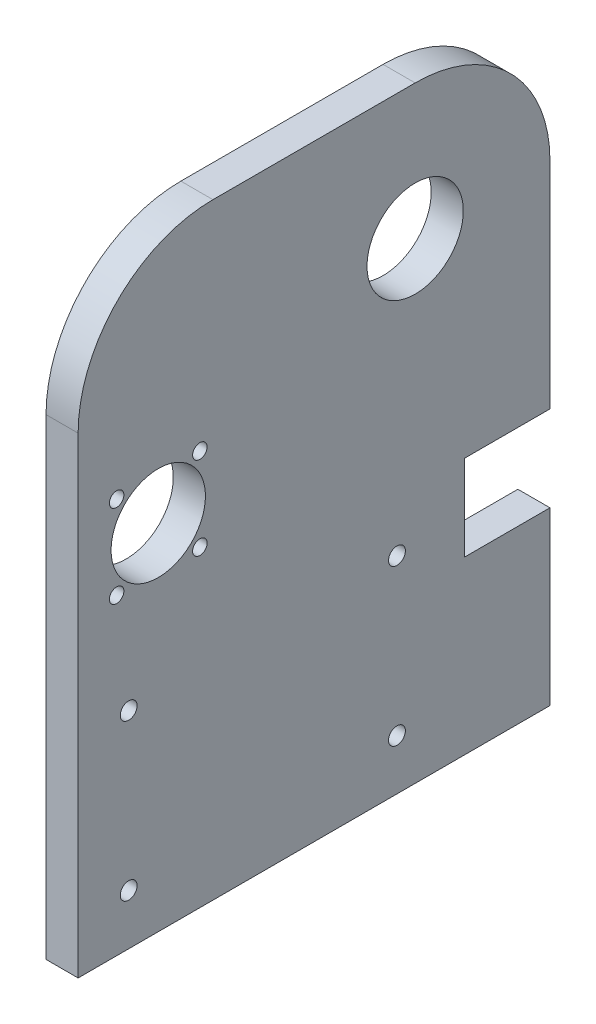
ISO-10303-21;
HEADER;
FILE_DESCRIPTION(('STEP AP214'),'2;1');
FILE_NAME('part.step','',(''),(''),'','','');
FILE_SCHEMA(('AUTOMOTIVE_DESIGN { 1 0 10303 214 1 1 1 1 }'));
ENDSEC;
DATA;
#1=APPLICATION_CONTEXT('core data for automotive mechanical design processes');
#2=APPLICATION_PROTOCOL_DEFINITION('international standard','automotive_design',2000,#1);
#3=PRODUCT_CONTEXT('',#1,'mechanical');
#4=PRODUCT('Part','Part','',(#3));
#5=PRODUCT_RELATED_PRODUCT_CATEGORY('part','',(#4));
#6=PRODUCT_DEFINITION_FORMATION('','',#4);
#7=PRODUCT_DEFINITION_CONTEXT('part definition',#1,'design');
#8=PRODUCT_DEFINITION('design','',#6,#7);
#9=PRODUCT_DEFINITION_SHAPE('','',#8);
#10=(LENGTH_UNIT() NAMED_UNIT(*) SI_UNIT(.MILLI.,.METRE.));
#11=(NAMED_UNIT(*) PLANE_ANGLE_UNIT() SI_UNIT($,.RADIAN.));
#12=(NAMED_UNIT(*) SI_UNIT($,.STERADIAN.) SOLID_ANGLE_UNIT());
#13=UNCERTAINTY_MEASURE_WITH_UNIT(LENGTH_MEASURE(1.E-05),#10,'distance_accuracy_value','');
#14=(GEOMETRIC_REPRESENTATION_CONTEXT(3) GLOBAL_UNCERTAINTY_ASSIGNED_CONTEXT((#13)) GLOBAL_UNIT_ASSIGNED_CONTEXT((#10,
#11,#12)) REPRESENTATION_CONTEXT('',''));
#15=CARTESIAN_POINT('',(0.,0.,0.));
#16=DIRECTION('',(0.,0.,1.));
#17=DIRECTION('',(1.,0.,0.));
#18=AXIS2_PLACEMENT_3D('',#15,#16,#17);
#19=CARTESIAN_POINT('',(-4.76250000000001,90.,-70.));
#20=DIRECTION('',(0.,0.,1.));
#21=DIRECTION('',(1.,0.,0.));
#22=AXIS2_PLACEMENT_3D('',#19,#20,#21);
#23=PLANE('',#22);
#24=DIRECTION('',(0.,-1.,0.));
#25=VECTOR('',#24,1.);
#26=CARTESIAN_POINT('',(-4.76250000000001,90.,-70.));
#27=LINE('',#26,#25);
#28=CARTESIAN_POINT('',(-4.76250000000001,50.,-70.));
#29=VERTEX_POINT('',#28);
#30=CARTESIAN_POINT('',(-4.76250000000001,-13.7746,-70.));
#31=VERTEX_POINT('',#30);
#32=EDGE_CURVE('E216',#29,#31,#27,.T.);
#33=ORIENTED_EDGE('',*,*,#32,.F.);
#34=DIRECTION('',(-1.,0.,0.));
#35=VECTOR('',#34,1.);
#36=CARTESIAN_POINT('',(4.76249999999999,50.,-70.));
#37=LINE('',#36,#35);
#38=CARTESIAN_POINT('',(4.76249999999999,50.,-70.));
#39=VERTEX_POINT('',#38);
#40=EDGE_CURVE('E11',#29,#39,#37,.F.);
#41=ORIENTED_EDGE('',*,*,#40,.T.);
#42=DIRECTION('',(0.,-1.,0.));
#43=VECTOR('',#42,1.);
#44=CARTESIAN_POINT('',(4.76249999999999,90.,-70.));
#45=LINE('',#44,#43);
#46=CARTESIAN_POINT('',(4.76250000000001,-13.7746,-70.));
#47=VERTEX_POINT('',#46);
#48=EDGE_CURVE('E219',#39,#47,#45,.T.);
#49=ORIENTED_EDGE('',*,*,#48,.T.);
#50=DIRECTION('',(-1.,0.,0.));
#51=VECTOR('',#50,1.);
#52=CARTESIAN_POINT('',(4.76250000000001,-13.7746,-70.));
#53=LINE('',#52,#51);
#54=EDGE_CURVE('E149',#47,#31,#53,.T.);
#55=ORIENTED_EDGE('',*,*,#54,.T.);
#56=EDGE_LOOP('',(#33,#41,#49,#55));
#57=FACE_BOUND('',#56,.T.);
#58=ADVANCED_FACE('F35',(#57),#23,.F.);
#59=CARTESIAN_POINT('',(4.76249999999999,90.,-70.));
#60=DIRECTION('',(-1.,0.,0.));
#61=DIRECTION('',(0.,0.,1.));
#62=AXIS2_PLACEMENT_3D('',#59,#60,#61);
#63=PLANE('',#62);
#64=CARTESIAN_POINT('',(4.76250000000002,-28.7746,-24.6));
#65=DIRECTION('',(-1.,0.,0.));
#66=DIRECTION('',(0.,0.,1.));
#67=AXIS2_PLACEMENT_3D('',#64,#65,#66);
#68=CIRCLE('',#67,2.5);
#69=CARTESIAN_POINT('',(4.76250000000002,-28.7746,-22.1));
#70=VERTEX_POINT('',#69);
#71=EDGE_CURVE('E352',#70,#70,#68,.T.);
#72=ORIENTED_EDGE('',*,*,#71,.T.);
#73=EDGE_LOOP('',(#72));
#74=FACE_BOUND('',#73,.T.);
#75=CARTESIAN_POINT('',(4.76250000000003,-28.7746,55.));
#76=DIRECTION('',(-1.,0.,0.));
#77=DIRECTION('',(0.,0.,1.));
#78=AXIS2_PLACEMENT_3D('',#75,#76,#77);
#79=CIRCLE('',#78,2.5);
#80=CARTESIAN_POINT('',(4.76250000000003,-28.7746,57.5));
#81=VERTEX_POINT('',#80);
#82=EDGE_CURVE('E361',#81,#81,#79,.T.);
#83=ORIENTED_EDGE('',*,*,#82,.T.);
#84=EDGE_LOOP('',(#83));
#85=FACE_BOUND('',#84,.T.);
#86=CARTESIAN_POINT('',(4.76250000000002,-75.,-24.6));
#87=DIRECTION('',(-1.,0.,0.));
#88=DIRECTION('',(0.,0.,1.));
#89=AXIS2_PLACEMENT_3D('',#86,#87,#88);
#90=CIRCLE('',#89,2.5);
#91=CARTESIAN_POINT('',(4.76250000000002,-75.,-22.1));
#92=VERTEX_POINT('',#91);
#93=EDGE_CURVE('E367',#92,#92,#90,.T.);
#94=ORIENTED_EDGE('',*,*,#93,.T.);
#95=EDGE_LOOP('',(#94));
#96=FACE_BOUND('',#95,.T.);
#97=CARTESIAN_POINT('',(4.76250000000003,-75.,55.));
#98=DIRECTION('',(-1.,0.,0.));
#99=DIRECTION('',(0.,0.,1.));
#100=AXIS2_PLACEMENT_3D('',#97,#98,#99);
#101=CIRCLE('',#100,2.5);
#102=CARTESIAN_POINT('',(4.76250000000003,-75.,57.5));
#103=VERTEX_POINT('',#102);
#104=EDGE_CURVE('E130',#103,#103,#101,.T.);
#105=ORIENTED_EDGE('',*,*,#104,.T.);
#106=EDGE_LOOP('',(#105));
#107=FACE_BOUND('',#106,.T.);
#108=CARTESIAN_POINT('',(4.76250000000001,15.,46.2289603759621));
#109=DIRECTION('',(-1.,0.,0.));
#110=DIRECTION('',(0.,0.,1.));
#111=AXIS2_PLACEMENT_3D('',#108,#109,#110);
#112=CIRCLE('',#111,14.);
#113=CARTESIAN_POINT('',(4.76250000000001,15.,60.2289603759621));
#114=VERTEX_POINT('',#113);
#115=EDGE_CURVE('E160',#114,#114,#112,.T.);
#116=ORIENTED_EDGE('',*,*,#115,.T.);
#117=EDGE_LOOP('',(#116));
#118=FACE_BOUND('',#117,.T.);
#119=CARTESIAN_POINT('',(4.76250000000001,2.65214783352988,58.5768125424322));
#120=DIRECTION('',(-1.,0.,0.));
#121=DIRECTION('',(0.,0.,1.));
#122=AXIS2_PLACEMENT_3D('',#119,#120,#121);
#123=CIRCLE('',#122,2.15);
#124=CARTESIAN_POINT('',(4.76250000000001,2.65214783352988,60.7268125424321));
#125=VERTEX_POINT('',#124);
#126=EDGE_CURVE('E166',#125,#125,#123,.T.);
#127=ORIENTED_EDGE('',*,*,#126,.T.);
#128=EDGE_LOOP('',(#127));
#129=FACE_BOUND('',#128,.T.);
#130=CARTESIAN_POINT('',(4.76250000000001,2.65214783352988,33.881108209492));
#131=DIRECTION('',(-1.,0.,0.));
#132=DIRECTION('',(0.,0.,1.));
#133=AXIS2_PLACEMENT_3D('',#130,#131,#132);
#134=CIRCLE('',#133,2.15);
#135=CARTESIAN_POINT('',(4.76250000000001,2.65214783352988,36.031108209492));
#136=VERTEX_POINT('',#135);
#137=EDGE_CURVE('E172',#136,#136,#134,.T.);
#138=ORIENTED_EDGE('',*,*,#137,.T.);
#139=EDGE_LOOP('',(#138));
#140=FACE_BOUND('',#139,.T.);
#141=CARTESIAN_POINT('',(4.76250000000001,27.3478521664701,58.5768125424321));
#142=DIRECTION('',(-1.,0.,0.));
#143=DIRECTION('',(0.,0.,1.));
#144=AXIS2_PLACEMENT_3D('',#141,#142,#143);
#145=CIRCLE('',#144,2.15);
#146=CARTESIAN_POINT('',(4.76250000000001,27.3478521664701,60.7268125424321));
#147=VERTEX_POINT('',#146);
#148=EDGE_CURVE('E178',#147,#147,#145,.T.);
#149=ORIENTED_EDGE('',*,*,#148,.T.);
#150=EDGE_LOOP('',(#149));
#151=FACE_BOUND('',#150,.T.);
#152=CARTESIAN_POINT('',(4.76250000000001,27.3478521664701,33.881108209492));
#153=DIRECTION('',(-1.,0.,0.));
#154=DIRECTION('',(0.,0.,1.));
#155=AXIS2_PLACEMENT_3D('',#152,#153,#154);
#156=CIRCLE('',#155,2.15);
#157=CARTESIAN_POINT('',(4.76250000000001,27.3478521664701,36.031108209492));
#158=VERTEX_POINT('',#157);
#159=EDGE_CURVE('E184',#158,#158,#156,.T.);
#160=ORIENTED_EDGE('',*,*,#159,.T.);
#161=EDGE_LOOP('',(#160));
#162=FACE_BOUND('',#161,.T.);
#163=CARTESIAN_POINT('',(4.7625,50.,-30.));
#164=DIRECTION('',(-1.,0.,0.));
#165=DIRECTION('',(0.,0.,1.));
#166=AXIS2_PLACEMENT_3D('',#163,#164,#165);
#167=CIRCLE('',#166,14.29);
#168=CARTESIAN_POINT('',(4.7625,50.,-15.71));
#169=VERTEX_POINT('',#168);
#170=EDGE_CURVE('E190',#169,#169,#167,.T.);
#171=ORIENTED_EDGE('',*,*,#170,.T.);
#172=EDGE_LOOP('',(#171));
#173=FACE_BOUND('',#172,.T.);
#174=DIRECTION('',(0.,0.,-1.));
#175=VECTOR('',#174,1.);
#176=CARTESIAN_POINT('',(4.76249999999999,90.,-70.));
#177=LINE('',#176,#175);
#178=CARTESIAN_POINT('',(4.7625,90.,30.));
#179=VERTEX_POINT('',#178);
#180=CARTESIAN_POINT('',(4.7625,90.,-30.));
#181=VERTEX_POINT('',#180);
#182=EDGE_CURVE('E194',#179,#181,#177,.T.);
#183=ORIENTED_EDGE('',*,*,#182,.F.);
#184=CARTESIAN_POINT('',(4.7625,50.,30.));
#185=DIRECTION('',(-1.,0.,0.));
#186=DIRECTION('',(0.,0.,1.));
#187=AXIS2_PLACEMENT_3D('',#184,#185,#186);
#188=CIRCLE('',#187,40.);
#189=CARTESIAN_POINT('',(4.76250000000001,50.,70.));
#190=VERTEX_POINT('',#189);
#191=EDGE_CURVE('E229',#179,#190,#188,.F.);
#192=ORIENTED_EDGE('',*,*,#191,.T.);
#193=DIRECTION('',(0.,-1.,0.));
#194=VECTOR('',#193,1.);
#195=CARTESIAN_POINT('',(4.76250000000001,90.,70.));
#196=LINE('',#195,#194);
#197=CARTESIAN_POINT('',(4.76250000000001,-90.,70.));
#198=VERTEX_POINT('',#197);
#199=EDGE_CURVE('E201',#190,#198,#196,.T.);
#200=ORIENTED_EDGE('',*,*,#199,.T.);
#201=DIRECTION('',(0.,0.,-1.));
#202=VECTOR('',#201,1.);
#203=CARTESIAN_POINT('',(4.76249999999999,-90.,-70.));
#204=LINE('',#203,#202);
#205=CARTESIAN_POINT('',(4.76249999999999,-90.,-70.));
#206=VERTEX_POINT('',#205);
#207=EDGE_CURVE('E193',#198,#206,#204,.T.);
#208=ORIENTED_EDGE('',*,*,#207,.T.);
#209=CARTESIAN_POINT('',(4.76250000000001,-39.1746,-70.));
#210=VERTEX_POINT('',#209);
#211=EDGE_CURVE('E218',#210,#206,#45,.T.);
#212=ORIENTED_EDGE('',*,*,#211,.F.);
#213=DIRECTION('',(0.,0.,1.));
#214=VECTOR('',#213,1.);
#215=CARTESIAN_POINT('',(4.76250000000001,-39.1746,-70.));
#216=LINE('',#215,#214);
#217=CARTESIAN_POINT('',(4.76250000000002,-39.1746,-44.6));
#218=VERTEX_POINT('',#217);
#219=EDGE_CURVE('E134',#210,#218,#216,.T.);
#220=ORIENTED_EDGE('',*,*,#219,.T.);
#221=DIRECTION('',(0.,1.,0.));
#222=VECTOR('',#221,1.);
#223=CARTESIAN_POINT('',(4.76250000000002,-13.7746,-44.6));
#224=LINE('',#223,#222);
#225=CARTESIAN_POINT('',(4.76250000000002,-13.7746,-44.6));
#226=VERTEX_POINT('',#225);
#227=EDGE_CURVE('E137',#218,#226,#224,.T.);
#228=ORIENTED_EDGE('',*,*,#227,.T.);
#229=DIRECTION('',(0.,0.,-1.));
#230=VECTOR('',#229,1.);
#231=CARTESIAN_POINT('',(4.76250000000001,-13.7746,-70.));
#232=LINE('',#231,#230);
#233=EDGE_CURVE('E141',#226,#47,#232,.T.);
#234=ORIENTED_EDGE('',*,*,#233,.T.);
#235=ORIENTED_EDGE('',*,*,#48,.F.);
#236=CARTESIAN_POINT('',(4.7625,50.,-30.));
#237=DIRECTION('',(-1.,0.,0.));
#238=DIRECTION('',(0.,0.,1.));
#239=AXIS2_PLACEMENT_3D('',#236,#237,#238);
#240=CIRCLE('',#239,40.);
#241=EDGE_CURVE('E227',#39,#181,#240,.F.);
#242=ORIENTED_EDGE('',*,*,#241,.T.);
#243=EDGE_LOOP('',(#183,#192,#200,#208,#212,#220,#228,#234,#235,#242));
#244=FACE_BOUND('',#243,.T.);
#245=ADVANCED_FACE('F242',(#74,#85,#96,#107,#118,#129,#140,#151,#162,#173,#244),#63,.F.);
#246=CARTESIAN_POINT('',(-4.76250000000001,-39.1745999999999,-70.));
#247=VERTEX_POINT('',#246);
#248=CARTESIAN_POINT('',(-4.76250000000001,-90.,-70.));
#249=VERTEX_POINT('',#248);
#250=EDGE_CURVE('E215',#247,#249,#27,.T.);
#251=ORIENTED_EDGE('',*,*,#250,.F.);
#252=DIRECTION('',(-1.,0.,0.));
#253=VECTOR('',#252,1.);
#254=CARTESIAN_POINT('',(4.76250000000001,-39.1746,-70.));
#255=LINE('',#254,#253);
#256=EDGE_CURVE('E143',#210,#247,#255,.T.);
#257=ORIENTED_EDGE('',*,*,#256,.F.);
#258=ORIENTED_EDGE('',*,*,#211,.T.);
#259=DIRECTION('',(-1.,0.,0.));
#260=VECTOR('',#259,1.);
#261=CARTESIAN_POINT('',(-4.76250000000001,-90.,-70.));
#262=LINE('',#261,#260);
#263=EDGE_CURVE('E204',#206,#249,#262,.T.);
#264=ORIENTED_EDGE('',*,*,#263,.T.);
#265=EDGE_LOOP('',(#251,#257,#258,#264));
#266=FACE_BOUND('',#265,.T.);
#267=ADVANCED_FACE('F254',(#266),#23,.F.);
#268=CARTESIAN_POINT('',(-4.76250000000001,90.,-70.));
#269=DIRECTION('',(1.,0.,0.));
#270=DIRECTION('',(0.,0.,-1.));
#271=AXIS2_PLACEMENT_3D('',#268,#269,#270);
#272=PLANE('',#271);
#273=CARTESIAN_POINT('',(-4.7625,-28.7746,-24.6));
#274=DIRECTION('',(-1.,0.,0.));
#275=DIRECTION('',(0.,0.,1.));
#276=AXIS2_PLACEMENT_3D('',#273,#274,#275);
#277=CIRCLE('',#276,2.49999999999999);
#278=CARTESIAN_POINT('',(-4.7625,-28.7746,-22.1));
#279=VERTEX_POINT('',#278);
#280=EDGE_CURVE('E354',#279,#279,#277,.T.);
#281=ORIENTED_EDGE('',*,*,#280,.F.);
#282=EDGE_LOOP('',(#281));
#283=FACE_BOUND('',#282,.T.);
#284=CARTESIAN_POINT('',(-4.76249999999999,-28.7746,55.));
#285=DIRECTION('',(-1.,0.,0.));
#286=DIRECTION('',(0.,0.,1.));
#287=AXIS2_PLACEMENT_3D('',#284,#285,#286);
#288=CIRCLE('',#287,2.49999999999999);
#289=CARTESIAN_POINT('',(-4.76249999999999,-28.7746,57.5));
#290=VERTEX_POINT('',#289);
#291=EDGE_CURVE('E356',#290,#290,#288,.T.);
#292=ORIENTED_EDGE('',*,*,#291,.F.);
#293=EDGE_LOOP('',(#292));
#294=FACE_BOUND('',#293,.T.);
#295=CARTESIAN_POINT('',(-4.7625,-75.,-24.6));
#296=DIRECTION('',(-1.,0.,0.));
#297=DIRECTION('',(0.,0.,1.));
#298=AXIS2_PLACEMENT_3D('',#295,#296,#297);
#299=CIRCLE('',#298,2.49999999999999);
#300=CARTESIAN_POINT('',(-4.7625,-75.,-22.1));
#301=VERTEX_POINT('',#300);
#302=EDGE_CURVE('E364',#301,#301,#299,.T.);
#303=ORIENTED_EDGE('',*,*,#302,.F.);
#304=EDGE_LOOP('',(#303));
#305=FACE_BOUND('',#304,.T.);
#306=CARTESIAN_POINT('',(-4.76249999999999,-75.,55.));
#307=DIRECTION('',(-1.,0.,0.));
#308=DIRECTION('',(0.,0.,1.));
#309=AXIS2_PLACEMENT_3D('',#306,#307,#308);
#310=CIRCLE('',#309,2.49999999999999);
#311=CARTESIAN_POINT('',(-4.76249999999999,-75.,57.5));
#312=VERTEX_POINT('',#311);
#313=EDGE_CURVE('E370',#312,#312,#310,.T.);
#314=ORIENTED_EDGE('',*,*,#313,.F.);
#315=EDGE_LOOP('',(#314));
#316=FACE_BOUND('',#315,.T.);
#317=CARTESIAN_POINT('',(-4.76249999999999,15.,46.2289603759621));
#318=DIRECTION('',(-1.,0.,0.));
#319=DIRECTION('',(0.,0.,1.));
#320=AXIS2_PLACEMENT_3D('',#317,#318,#319);
#321=CIRCLE('',#320,14.);
#322=CARTESIAN_POINT('',(-4.76249999999999,15.,60.2289603759621));
#323=VERTEX_POINT('',#322);
#324=EDGE_CURVE('E152',#323,#323,#321,.T.);
#325=ORIENTED_EDGE('',*,*,#324,.F.);
#326=EDGE_LOOP('',(#325));
#327=FACE_BOUND('',#326,.T.);
#328=CARTESIAN_POINT('',(-4.76249999999999,2.65214783352988,58.5768125424322));
#329=DIRECTION('',(-1.,0.,0.));
#330=DIRECTION('',(0.,0.,1.));
#331=AXIS2_PLACEMENT_3D('',#328,#329,#330);
#332=CIRCLE('',#331,2.15);
#333=CARTESIAN_POINT('',(-4.76249999999999,2.65214783352988,60.7268125424322));
#334=VERTEX_POINT('',#333);
#335=EDGE_CURVE('E163',#334,#334,#332,.T.);
#336=ORIENTED_EDGE('',*,*,#335,.F.);
#337=EDGE_LOOP('',(#336));
#338=FACE_BOUND('',#337,.T.);
#339=CARTESIAN_POINT('',(-4.76249999999999,2.65214783352988,33.881108209492));
#340=DIRECTION('',(-1.,0.,0.));
#341=DIRECTION('',(0.,0.,1.));
#342=AXIS2_PLACEMENT_3D('',#339,#340,#341);
#343=CIRCLE('',#342,2.15);
#344=CARTESIAN_POINT('',(-4.76249999999999,2.65214783352988,36.031108209492));
#345=VERTEX_POINT('',#344);
#346=EDGE_CURVE('E169',#345,#345,#343,.T.);
#347=ORIENTED_EDGE('',*,*,#346,.F.);
#348=EDGE_LOOP('',(#347));
#349=FACE_BOUND('',#348,.T.);
#350=CARTESIAN_POINT('',(-4.76249999999999,27.3478521664701,58.5768125424322));
#351=DIRECTION('',(-1.,0.,0.));
#352=DIRECTION('',(0.,0.,1.));
#353=AXIS2_PLACEMENT_3D('',#350,#351,#352);
#354=CIRCLE('',#353,2.15);
#355=CARTESIAN_POINT('',(-4.76249999999999,27.3478521664701,60.7268125424321));
#356=VERTEX_POINT('',#355);
#357=EDGE_CURVE('E175',#356,#356,#354,.T.);
#358=ORIENTED_EDGE('',*,*,#357,.F.);
#359=EDGE_LOOP('',(#358));
#360=FACE_BOUND('',#359,.T.);
#361=CARTESIAN_POINT('',(-4.76249999999999,27.3478521664701,33.881108209492));
#362=DIRECTION('',(-1.,0.,0.));
#363=DIRECTION('',(0.,0.,1.));
#364=AXIS2_PLACEMENT_3D('',#361,#362,#363);
#365=CIRCLE('',#364,2.15);
#366=CARTESIAN_POINT('',(-4.76249999999999,27.3478521664701,36.031108209492));
#367=VERTEX_POINT('',#366);
#368=EDGE_CURVE('E181',#367,#367,#365,.T.);
#369=ORIENTED_EDGE('',*,*,#368,.F.);
#370=EDGE_LOOP('',(#369));
#371=FACE_BOUND('',#370,.T.);
#372=CARTESIAN_POINT('',(-4.7625,50.,-30.));
#373=DIRECTION('',(-1.,0.,0.));
#374=DIRECTION('',(0.,0.,1.));
#375=AXIS2_PLACEMENT_3D('',#372,#373,#374);
#376=CIRCLE('',#375,14.29);
#377=CARTESIAN_POINT('',(-4.7625,50.,-15.71));
#378=VERTEX_POINT('',#377);
#379=EDGE_CURVE('E187',#378,#378,#376,.T.);
#380=ORIENTED_EDGE('',*,*,#379,.F.);
#381=EDGE_LOOP('',(#380));
#382=FACE_BOUND('',#381,.T.);
#383=DIRECTION('',(0.,-1.,0.));
#384=VECTOR('',#383,1.);
#385=CARTESIAN_POINT('',(-4.76249999999999,90.,70.));
#386=LINE('',#385,#384);
#387=CARTESIAN_POINT('',(-4.76249999999999,50.,70.));
#388=VERTEX_POINT('',#387);
#389=CARTESIAN_POINT('',(-4.76249999999999,-90.,70.));
#390=VERTEX_POINT('',#389);
#391=EDGE_CURVE('E213',#388,#390,#386,.T.);
#392=ORIENTED_EDGE('',*,*,#391,.F.);
#393=CARTESIAN_POINT('',(-4.7625,50.,30.));
#394=DIRECTION('',(1.,0.,0.));
#395=DIRECTION('',(0.,0.,-1.));
#396=AXIS2_PLACEMENT_3D('',#393,#394,#395);
#397=CIRCLE('',#396,40.);
#398=CARTESIAN_POINT('',(-4.7625,90.,30.));
#399=VERTEX_POINT('',#398);
#400=EDGE_CURVE('E43',#388,#399,#397,.F.);
#401=ORIENTED_EDGE('',*,*,#400,.T.);
#402=DIRECTION('',(0.,0.,1.));
#403=VECTOR('',#402,1.);
#404=CARTESIAN_POINT('',(-4.76250000000001,90.,-70.));
#405=LINE('',#404,#403);
#406=CARTESIAN_POINT('',(-4.7625,90.,-30.));
#407=VERTEX_POINT('',#406);
#408=EDGE_CURVE('E197',#407,#399,#405,.T.);
#409=ORIENTED_EDGE('',*,*,#408,.F.);
#410=CARTESIAN_POINT('',(-4.7625,50.,-30.));
#411=DIRECTION('',(1.,0.,0.));
#412=DIRECTION('',(0.,0.,-1.));
#413=AXIS2_PLACEMENT_3D('',#410,#411,#412);
#414=CIRCLE('',#413,40.);
#415=EDGE_CURVE('E50',#407,#29,#414,.F.);
#416=ORIENTED_EDGE('',*,*,#415,.T.);
#417=ORIENTED_EDGE('',*,*,#32,.T.);
#418=DIRECTION('',(0.,0.,-1.));
#419=VECTOR('',#418,1.);
#420=CARTESIAN_POINT('',(-4.76250000000001,-13.7746,-70.));
#421=LINE('',#420,#419);
#422=CARTESIAN_POINT('',(-4.7625,-13.7746,-44.6));
#423=VERTEX_POINT('',#422);
#424=EDGE_CURVE('E138',#423,#31,#421,.T.);
#425=ORIENTED_EDGE('',*,*,#424,.F.);
#426=DIRECTION('',(0.,1.,0.));
#427=VECTOR('',#426,1.);
#428=CARTESIAN_POINT('',(-4.7625,-13.7746,-44.6));
#429=LINE('',#428,#427);
#430=CARTESIAN_POINT('',(-4.7625,-39.1746,-44.6));
#431=VERTEX_POINT('',#430);
#432=EDGE_CURVE('E127',#431,#423,#429,.T.);
#433=ORIENTED_EDGE('',*,*,#432,.F.);
#434=DIRECTION('',(0.,0.,1.));
#435=VECTOR('',#434,1.);
#436=CARTESIAN_POINT('',(-4.76250000000001,-39.1746,-70.));
#437=LINE('',#436,#435);
#438=EDGE_CURVE('E123',#247,#431,#437,.T.);
#439=ORIENTED_EDGE('',*,*,#438,.F.);
#440=ORIENTED_EDGE('',*,*,#250,.T.);
#441=DIRECTION('',(0.,0.,1.));
#442=VECTOR('',#441,1.);
#443=CARTESIAN_POINT('',(-4.76250000000001,-90.,-70.));
#444=LINE('',#443,#442);
#445=EDGE_CURVE('E207',#249,#390,#444,.T.);
#446=ORIENTED_EDGE('',*,*,#445,.T.);
#447=EDGE_LOOP('',(#392,#401,#409,#416,#417,#425,#433,#439,#440,#446));
#448=FACE_BOUND('',#447,.T.);
#449=ADVANCED_FACE('F233',(#283,#294,#305,#316,#327,#338,#349,#360,#371,#382,#448),#272,.F.);
#450=CARTESIAN_POINT('',(-4.76249999999999,90.,70.));
#451=DIRECTION('',(0.,0.,-1.));
#452=DIRECTION('',(-1.,0.,0.));
#453=AXIS2_PLACEMENT_3D('',#450,#451,#452);
#454=PLANE('',#453);
#455=ORIENTED_EDGE('',*,*,#199,.F.);
#456=DIRECTION('',(1.,0.,0.));
#457=VECTOR('',#456,1.);
#458=CARTESIAN_POINT('',(-4.76249999999999,50.,70.));
#459=LINE('',#458,#457);
#460=EDGE_CURVE('E58',#190,#388,#459,.F.);
#461=ORIENTED_EDGE('',*,*,#460,.T.);
#462=ORIENTED_EDGE('',*,*,#391,.T.);
#463=DIRECTION('',(1.,0.,0.));
#464=VECTOR('',#463,1.);
#465=CARTESIAN_POINT('',(-4.76249999999999,-90.,70.));
#466=LINE('',#465,#464);
#467=EDGE_CURVE('E198',#390,#198,#466,.T.);
#468=ORIENTED_EDGE('',*,*,#467,.T.);
#469=EDGE_LOOP('',(#455,#461,#462,#468));
#470=FACE_BOUND('',#469,.T.);
#471=ADVANCED_FACE('F243',(#470),#454,.F.);
#472=CARTESIAN_POINT('',(0.,90.,0.));
#473=DIRECTION('',(0.,1.,0.));
#474=DIRECTION('',(0.,0.,1.));
#475=AXIS2_PLACEMENT_3D('',#472,#473,#474);
#476=PLANE('',#475);
#477=ORIENTED_EDGE('',*,*,#408,.T.);
#478=DIRECTION('',(1.,0.,0.));
#479=VECTOR('',#478,1.);
#480=CARTESIAN_POINT('',(4.76250000000001,90.,30.));
#481=LINE('',#480,#479);
#482=EDGE_CURVE('E224',#399,#179,#481,.T.);
#483=ORIENTED_EDGE('',*,*,#482,.T.);
#484=ORIENTED_EDGE('',*,*,#182,.T.);
#485=DIRECTION('',(-1.,0.,0.));
#486=VECTOR('',#485,1.);
#487=CARTESIAN_POINT('',(-4.76250000000001,90.,-30.));
#488=LINE('',#487,#486);
#489=EDGE_CURVE('E221',#181,#407,#488,.T.);
#490=ORIENTED_EDGE('',*,*,#489,.T.);
#491=EDGE_LOOP('',(#477,#483,#484,#490));
#492=FACE_BOUND('',#491,.T.);
#493=ADVANCED_FACE('F237',(#492),#476,.T.);
#494=CARTESIAN_POINT('',(0.,-90.,0.));
#495=DIRECTION('',(0.,1.,0.));
#496=DIRECTION('',(0.,0.,1.));
#497=AXIS2_PLACEMENT_3D('',#494,#495,#496);
#498=PLANE('',#497);
#499=ORIENTED_EDGE('',*,*,#207,.F.);
#500=ORIENTED_EDGE('',*,*,#467,.F.);
#501=ORIENTED_EDGE('',*,*,#445,.F.);
#502=ORIENTED_EDGE('',*,*,#263,.F.);
#503=EDGE_LOOP('',(#499,#500,#501,#502));
#504=FACE_BOUND('',#503,.T.);
#505=ADVANCED_FACE('F249',(#504),#498,.F.);
#506=CARTESIAN_POINT('',(23.8125,50.,-30.));
#507=DIRECTION('',(-1.,0.,0.));
#508=DIRECTION('',(0.,0.,1.));
#509=AXIS2_PLACEMENT_3D('',#506,#507,#508);
#510=CYLINDRICAL_SURFACE('',#509,14.29);
#511=ORIENTED_EDGE('',*,*,#379,.T.);
#512=EDGE_LOOP('',(#511));
#513=FACE_BOUND('',#512,.T.);
#514=ORIENTED_EDGE('',*,*,#170,.F.);
#515=EDGE_LOOP('',(#514));
#516=FACE_BOUND('',#515,.T.);
#517=ADVANCED_FACE('F298',(#513,#516),#510,.F.);
#518=CARTESIAN_POINT('',(23.8125,27.3478521664701,33.881108209492));
#519=DIRECTION('',(-1.,0.,0.));
#520=DIRECTION('',(0.,0.,1.));
#521=AXIS2_PLACEMENT_3D('',#518,#519,#520);
#522=CYLINDRICAL_SURFACE('',#521,2.15);
#523=ORIENTED_EDGE('',*,*,#368,.T.);
#524=EDGE_LOOP('',(#523));
#525=FACE_BOUND('',#524,.T.);
#526=ORIENTED_EDGE('',*,*,#159,.F.);
#527=EDGE_LOOP('',(#526));
#528=FACE_BOUND('',#527,.T.);
#529=ADVANCED_FACE('F303',(#525,#528),#522,.F.);
#530=CARTESIAN_POINT('',(23.8125,27.3478521664701,58.5768125424321));
#531=DIRECTION('',(-1.,0.,0.));
#532=DIRECTION('',(0.,0.,1.));
#533=AXIS2_PLACEMENT_3D('',#530,#531,#532);
#534=CYLINDRICAL_SURFACE('',#533,2.15);
#535=ORIENTED_EDGE('',*,*,#357,.T.);
#536=EDGE_LOOP('',(#535));
#537=FACE_BOUND('',#536,.T.);
#538=ORIENTED_EDGE('',*,*,#148,.F.);
#539=EDGE_LOOP('',(#538));
#540=FACE_BOUND('',#539,.T.);
#541=ADVANCED_FACE('F307',(#537,#540),#534,.F.);
#542=CARTESIAN_POINT('',(23.8125,2.65214783352988,33.881108209492));
#543=DIRECTION('',(-1.,0.,0.));
#544=DIRECTION('',(0.,0.,1.));
#545=AXIS2_PLACEMENT_3D('',#542,#543,#544);
#546=CYLINDRICAL_SURFACE('',#545,2.15);
#547=ORIENTED_EDGE('',*,*,#346,.T.);
#548=EDGE_LOOP('',(#547));
#549=FACE_BOUND('',#548,.T.);
#550=ORIENTED_EDGE('',*,*,#137,.F.);
#551=EDGE_LOOP('',(#550));
#552=FACE_BOUND('',#551,.T.);
#553=ADVANCED_FACE('F311',(#549,#552),#546,.F.);
#554=CARTESIAN_POINT('',(23.8125,2.65214783352988,58.5768125424322));
#555=DIRECTION('',(-1.,0.,0.));
#556=DIRECTION('',(0.,0.,1.));
#557=AXIS2_PLACEMENT_3D('',#554,#555,#556);
#558=CYLINDRICAL_SURFACE('',#557,2.15);
#559=ORIENTED_EDGE('',*,*,#335,.T.);
#560=EDGE_LOOP('',(#559));
#561=FACE_BOUND('',#560,.T.);
#562=ORIENTED_EDGE('',*,*,#126,.F.);
#563=EDGE_LOOP('',(#562));
#564=FACE_BOUND('',#563,.T.);
#565=ADVANCED_FACE('F315',(#561,#564),#558,.F.);
#566=CARTESIAN_POINT('',(23.8125,15.,46.2289603759621));
#567=DIRECTION('',(-1.,0.,0.));
#568=DIRECTION('',(0.,0.,1.));
#569=AXIS2_PLACEMENT_3D('',#566,#567,#568);
#570=CYLINDRICAL_SURFACE('',#569,14.);
#571=ORIENTED_EDGE('',*,*,#324,.T.);
#572=EDGE_LOOP('',(#571));
#573=FACE_BOUND('',#572,.T.);
#574=ORIENTED_EDGE('',*,*,#115,.F.);
#575=EDGE_LOOP('',(#574));
#576=FACE_BOUND('',#575,.T.);
#577=ADVANCED_FACE('F319',(#573,#576),#570,.F.);
#578=CARTESIAN_POINT('',(4.76250000000001,-13.7746,-70.));
#579=DIRECTION('',(0.,1.,0.));
#580=DIRECTION('',(0.,0.,1.));
#581=AXIS2_PLACEMENT_3D('',#578,#579,#580);
#582=PLANE('',#581);
#583=ORIENTED_EDGE('',*,*,#424,.T.);
#584=ORIENTED_EDGE('',*,*,#54,.F.);
#585=ORIENTED_EDGE('',*,*,#233,.F.);
#586=DIRECTION('',(-1.,0.,0.));
#587=VECTOR('',#586,1.);
#588=CARTESIAN_POINT('',(4.76250000000002,-13.7746,-44.6));
#589=LINE('',#588,#587);
#590=EDGE_CURVE('E153',#226,#423,#589,.T.);
#591=ORIENTED_EDGE('',*,*,#590,.T.);
#592=EDGE_LOOP('',(#583,#584,#585,#591));
#593=FACE_BOUND('',#592,.T.);
#594=ADVANCED_FACE('F267',(#593),#582,.F.);
#595=CARTESIAN_POINT('',(4.76250000000002,-13.7746,-44.6));
#596=DIRECTION('',(0.,0.,1.));
#597=DIRECTION('',(0.,-1.,0.));
#598=AXIS2_PLACEMENT_3D('',#595,#596,#597);
#599=PLANE('',#598);
#600=CARTESIAN_POINT('',(0.,-26.4746,-44.6));
#601=DIRECTION('',(0.,0.,-1.));
#602=DIRECTION('',(-1.,0.,0.));
#603=AXIS2_PLACEMENT_3D('',#600,#601,#602);
#604=CIRCLE('',#603,2.5);
#605=CARTESIAN_POINT('',(-2.5,-26.4746,-44.6));
#606=VERTEX_POINT('',#605);
#607=EDGE_CURVE('E124',#606,#606,#604,.T.);
#608=ORIENTED_EDGE('',*,*,#607,.F.);
#609=EDGE_LOOP('',(#608));
#610=FACE_BOUND('',#609,.T.);
#611=ORIENTED_EDGE('',*,*,#432,.T.);
#612=ORIENTED_EDGE('',*,*,#590,.F.);
#613=ORIENTED_EDGE('',*,*,#227,.F.);
#614=DIRECTION('',(-1.,0.,0.));
#615=VECTOR('',#614,1.);
#616=CARTESIAN_POINT('',(4.76250000000002,-39.1746,-44.6));
#617=LINE('',#616,#615);
#618=EDGE_CURVE('E155',#218,#431,#617,.T.);
#619=ORIENTED_EDGE('',*,*,#618,.T.);
#620=EDGE_LOOP('',(#611,#612,#613,#619));
#621=FACE_BOUND('',#620,.T.);
#622=ADVANCED_FACE('F260',(#610,#621),#599,.F.);
#623=CARTESIAN_POINT('',(4.76250000000001,-39.1746,-70.));
#624=DIRECTION('',(0.,-1.,0.));
#625=DIRECTION('',(0.,0.,-1.));
#626=AXIS2_PLACEMENT_3D('',#623,#624,#625);
#627=PLANE('',#626);
#628=ORIENTED_EDGE('',*,*,#438,.T.);
#629=ORIENTED_EDGE('',*,*,#618,.F.);
#630=ORIENTED_EDGE('',*,*,#219,.F.);
#631=ORIENTED_EDGE('',*,*,#256,.T.);
#632=EDGE_LOOP('',(#628,#629,#630,#631));
#633=FACE_BOUND('',#632,.T.);
#634=ADVANCED_FACE('F117',(#633),#627,.F.);
#635=CARTESIAN_POINT('',(0.,-26.4746,-34.6));
#636=DIRECTION('',(0.,0.,-1.));
#637=DIRECTION('',(-1.,0.,0.));
#638=AXIS2_PLACEMENT_3D('',#635,#636,#637);
#639=CONICAL_SURFACE('',#638,2.5,1.02974425867665);
#640=CARTESIAN_POINT('',(0.,-26.4746,-33.0978484524311));
#641=VERTEX_POINT('',#640);
#642=VERTEX_LOOP('',#641);
#643=FACE_BOUND('',#642,.T.);
#644=CARTESIAN_POINT('',(0.,-26.4746,-34.6));
#645=DIRECTION('',(0.,0.,-1.));
#646=DIRECTION('',(-1.,0.,0.));
#647=AXIS2_PLACEMENT_3D('',#644,#645,#646);
#648=CIRCLE('',#647,2.5);
#649=CARTESIAN_POINT('',(-2.5,-26.4746,-34.6));
#650=VERTEX_POINT('',#649);
#651=EDGE_CURVE('E121',#650,#650,#648,.T.);
#652=ORIENTED_EDGE('',*,*,#651,.T.);
#653=EDGE_LOOP('',(#652));
#654=FACE_BOUND('',#653,.T.);
#655=ADVANCED_FACE('F113',(#643,#654),#639,.F.);
#656=CARTESIAN_POINT('',(0.,-26.4746,-44.6));
#657=DIRECTION('',(0.,0.,-1.));
#658=DIRECTION('',(-1.,0.,0.));
#659=AXIS2_PLACEMENT_3D('',#656,#657,#658);
#660=CYLINDRICAL_SURFACE('',#659,2.5);
#661=ORIENTED_EDGE('',*,*,#651,.F.);
#662=EDGE_LOOP('',(#661));
#663=FACE_BOUND('',#662,.T.);
#664=ORIENTED_EDGE('',*,*,#607,.T.);
#665=EDGE_LOOP('',(#664));
#666=FACE_BOUND('',#665,.T.);
#667=ADVANCED_FACE('F116',(#663,#666),#660,.F.);
#668=CARTESIAN_POINT('',(-4.76249999999999,-75.,55.));
#669=DIRECTION('',(-1.,0.,0.));
#670=DIRECTION('',(0.,0.,1.));
#671=AXIS2_PLACEMENT_3D('',#668,#669,#670);
#672=CYLINDRICAL_SURFACE('',#671,2.5);
#673=ORIENTED_EDGE('',*,*,#104,.F.);
#674=EDGE_LOOP('',(#673));
#675=FACE_BOUND('',#674,.T.);
#676=ORIENTED_EDGE('',*,*,#313,.T.);
#677=EDGE_LOOP('',(#676));
#678=FACE_BOUND('',#677,.T.);
#679=ADVANCED_FACE('F333',(#675,#678),#672,.F.);
#680=CARTESIAN_POINT('',(-4.7625,-75.,-24.6));
#681=DIRECTION('',(-1.,0.,0.));
#682=DIRECTION('',(0.,0.,1.));
#683=AXIS2_PLACEMENT_3D('',#680,#681,#682);
#684=CYLINDRICAL_SURFACE('',#683,2.5);
#685=ORIENTED_EDGE('',*,*,#93,.F.);
#686=EDGE_LOOP('',(#685));
#687=FACE_BOUND('',#686,.T.);
#688=ORIENTED_EDGE('',*,*,#302,.T.);
#689=EDGE_LOOP('',(#688));
#690=FACE_BOUND('',#689,.T.);
#691=ADVANCED_FACE('F336',(#687,#690),#684,.F.);
#692=CARTESIAN_POINT('',(-4.76249999999999,-28.7746,55.));
#693=DIRECTION('',(-1.,0.,0.));
#694=DIRECTION('',(0.,0.,1.));
#695=AXIS2_PLACEMENT_3D('',#692,#693,#694);
#696=CYLINDRICAL_SURFACE('',#695,2.49999999999999);
#697=ORIENTED_EDGE('',*,*,#82,.F.);
#698=EDGE_LOOP('',(#697));
#699=FACE_BOUND('',#698,.T.);
#700=ORIENTED_EDGE('',*,*,#291,.T.);
#701=EDGE_LOOP('',(#700));
#702=FACE_BOUND('',#701,.T.);
#703=ADVANCED_FACE('F340',(#699,#702),#696,.F.);
#704=CARTESIAN_POINT('',(-4.7625,-28.7746,-24.6));
#705=DIRECTION('',(-1.,0.,0.));
#706=DIRECTION('',(0.,0.,1.));
#707=AXIS2_PLACEMENT_3D('',#704,#705,#706);
#708=CYLINDRICAL_SURFACE('',#707,2.49999999999999);
#709=ORIENTED_EDGE('',*,*,#71,.F.);
#710=EDGE_LOOP('',(#709));
#711=FACE_BOUND('',#710,.T.);
#712=ORIENTED_EDGE('',*,*,#280,.T.);
#713=EDGE_LOOP('',(#712));
#714=FACE_BOUND('',#713,.T.);
#715=ADVANCED_FACE('F275',(#711,#714),#708,.F.);
#716=CARTESIAN_POINT('',(0.,50.,30.));
#717=DIRECTION('',(-1.,0.,0.));
#718=DIRECTION('',(0.,0.,1.));
#719=AXIS2_PLACEMENT_3D('',#716,#717,#718);
#720=CYLINDRICAL_SURFACE('',#719,40.);
#721=ORIENTED_EDGE('',*,*,#400,.F.);
#722=ORIENTED_EDGE('',*,*,#460,.F.);
#723=ORIENTED_EDGE('',*,*,#191,.F.);
#724=ORIENTED_EDGE('',*,*,#482,.F.);
#725=EDGE_LOOP('',(#721,#722,#723,#724));
#726=FACE_BOUND('',#725,.T.);
#727=ADVANCED_FACE('F240',(#726),#720,.T.);
#728=CARTESIAN_POINT('',(0.,50.,-30.));
#729=DIRECTION('',(1.,0.,0.));
#730=DIRECTION('',(0.,0.,-1.));
#731=AXIS2_PLACEMENT_3D('',#728,#729,#730);
#732=CYLINDRICAL_SURFACE('',#731,40.);
#733=ORIENTED_EDGE('',*,*,#241,.F.);
#734=ORIENTED_EDGE('',*,*,#40,.F.);
#735=ORIENTED_EDGE('',*,*,#415,.F.);
#736=ORIENTED_EDGE('',*,*,#489,.F.);
#737=EDGE_LOOP('',(#733,#734,#735,#736));
#738=FACE_BOUND('',#737,.T.);
#739=ADVANCED_FACE('F37',(#738),#732,.T.);
#740=CLOSED_SHELL('',(#58,#245,#267,#449,#471,#493,#505,#517,#529,#541,#553,#565,#577,#594,#622,
#634,#655,#667,#679,#691,#703,#715,#727,#739));
#741=MANIFOLD_SOLID_BREP('B2',#740);
#742=ADVANCED_BREP_SHAPE_REPRESENTATION('',(#18,#741),#14);
#743=SHAPE_DEFINITION_REPRESENTATION(#9,#742);
ENDSEC;
END-ISO-10303-21;
